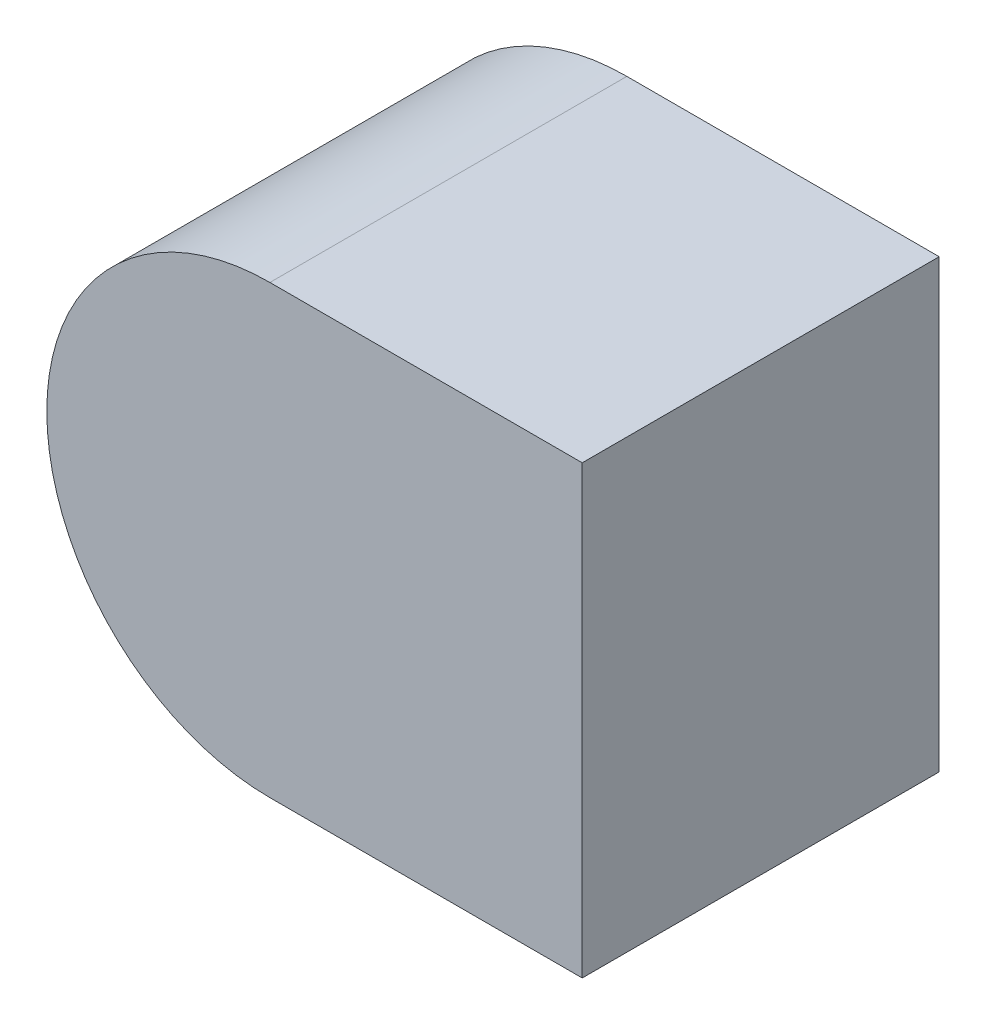
ISO-10303-21;
HEADER;
FILE_DESCRIPTION(('STEP AP214'),'2;1');
FILE_NAME('part.step','',(''),(''),'','','');
FILE_SCHEMA(('AUTOMOTIVE_DESIGN { 1 0 10303 214 1 1 1 1 }'));
ENDSEC;
DATA;
#1=APPLICATION_CONTEXT('core data for automotive mechanical design processes');
#2=APPLICATION_PROTOCOL_DEFINITION('international standard','automotive_design',2000,#1);
#3=PRODUCT_CONTEXT('',#1,'mechanical');
#4=PRODUCT('Part','Part','',(#3));
#5=PRODUCT_RELATED_PRODUCT_CATEGORY('part','',(#4));
#6=PRODUCT_DEFINITION_FORMATION('','',#4);
#7=PRODUCT_DEFINITION_CONTEXT('part definition',#1,'design');
#8=PRODUCT_DEFINITION('design','',#6,#7);
#9=PRODUCT_DEFINITION_SHAPE('','',#8);
#10=(LENGTH_UNIT() NAMED_UNIT(*) SI_UNIT(.MILLI.,.METRE.));
#11=(NAMED_UNIT(*) PLANE_ANGLE_UNIT() SI_UNIT($,.RADIAN.));
#12=(NAMED_UNIT(*) SI_UNIT($,.STERADIAN.) SOLID_ANGLE_UNIT());
#13=UNCERTAINTY_MEASURE_WITH_UNIT(LENGTH_MEASURE(1.E-05),#10,'distance_accuracy_value','');
#14=(GEOMETRIC_REPRESENTATION_CONTEXT(3) GLOBAL_UNCERTAINTY_ASSIGNED_CONTEXT((#13)) GLOBAL_UNIT_ASSIGNED_CONTEXT((#10,
#11,#12)) REPRESENTATION_CONTEXT('',''));
#15=CARTESIAN_POINT('',(0.,0.,0.));
#16=DIRECTION('',(0.,0.,1.));
#17=DIRECTION('',(1.,0.,0.));
#18=AXIS2_PLACEMENT_3D('',#15,#16,#17);
#19=CARTESIAN_POINT('',(0.703,-0.625,0.));
#20=DIRECTION('',(0.,-1.,0.));
#21=DIRECTION('',(1.,0.,0.));
#22=AXIS2_PLACEMENT_3D('',#19,#20,#21);
#23=PLANE('',#22);
#24=DIRECTION('',(0.,0.,1.));
#25=VECTOR('',#24,1.);
#26=CARTESIAN_POINT('',(0.828,-0.625,0.));
#27=LINE('',#26,#25);
#28=CARTESIAN_POINT('',(0.828,-0.625,0.));
#29=VERTEX_POINT('',#28);
#30=CARTESIAN_POINT('',(0.828,-0.625,0.2));
#31=VERTEX_POINT('',#30);
#32=EDGE_CURVE('E11',#29,#31,#27,.T.);
#33=ORIENTED_EDGE('',*,*,#32,.T.);
#34=DIRECTION('',(1.,0.,0.));
#35=VECTOR('',#34,1.);
#36=CARTESIAN_POINT('',(0.703,-0.625,0.2));
#37=LINE('',#36,#35);
#38=CARTESIAN_POINT('',(1.003,-0.625,0.2));
#39=VERTEX_POINT('',#38);
#40=EDGE_CURVE('E24',#31,#39,#37,.T.);
#41=ORIENTED_EDGE('',*,*,#40,.T.);
#42=DIRECTION('',(0.,0.,1.));
#43=VECTOR('',#42,1.);
#44=CARTESIAN_POINT('',(1.003,-0.625,0.));
#45=LINE('',#44,#43);
#46=CARTESIAN_POINT('',(1.003,-0.625,0.));
#47=VERTEX_POINT('',#46);
#48=EDGE_CURVE('E75',#47,#39,#45,.T.);
#49=ORIENTED_EDGE('',*,*,#48,.F.);
#50=DIRECTION('',(1.,0.,0.));
#51=VECTOR('',#50,1.);
#52=CARTESIAN_POINT('',(0.703,-0.625,0.));
#53=LINE('',#52,#51);
#54=EDGE_CURVE('E86',#29,#47,#53,.T.);
#55=ORIENTED_EDGE('',*,*,#54,.F.);
#56=EDGE_LOOP('',(#33,#41,#49,#55));
#57=FACE_BOUND('',#56,.T.);
#58=ADVANCED_FACE('F17',(#57),#23,.F.);
#59=CARTESIAN_POINT('',(0.852999999999999,-0.75,0.));
#60=DIRECTION('',(0.,0.,-1.));
#61=DIRECTION('',(-1.,0.,0.));
#62=AXIS2_PLACEMENT_3D('',#59,#60,#61);
#63=PLANE('',#62);
#64=CARTESIAN_POINT('',(0.828,-0.75,0.));
#65=DIRECTION('',(0.,0.,-1.));
#66=DIRECTION('',(-0.707106781186548,0.707106781186547,0.));
#67=AXIS2_PLACEMENT_3D('',#64,#65,#66);
#68=CIRCLE('',#67,0.125);
#69=CARTESIAN_POINT('',(0.828,-0.875,0.));
#70=VERTEX_POINT('',#69);
#71=EDGE_CURVE('E83',#70,#29,#68,.T.);
#72=ORIENTED_EDGE('',*,*,#71,.T.);
#73=ORIENTED_EDGE('',*,*,#54,.T.);
#74=DIRECTION('',(0.,-1.,0.));
#75=VECTOR('',#74,1.);
#76=CARTESIAN_POINT('',(1.003,-0.625,0.));
#77=LINE('',#76,#75);
#78=CARTESIAN_POINT('',(1.003,-0.875,0.));
#79=VERTEX_POINT('',#78);
#80=EDGE_CURVE('E81',#47,#79,#77,.T.);
#81=ORIENTED_EDGE('',*,*,#80,.T.);
#82=DIRECTION('',(-1.,0.,0.));
#83=VECTOR('',#82,1.);
#84=CARTESIAN_POINT('',(1.003,-0.875,0.));
#85=LINE('',#84,#83);
#86=EDGE_CURVE('E60',#79,#70,#85,.T.);
#87=ORIENTED_EDGE('',*,*,#86,.T.);
#88=EDGE_LOOP('',(#72,#73,#81,#87));
#89=FACE_BOUND('',#88,.T.);
#90=ADVANCED_FACE('F91',(#89),#63,.T.);
#91=CARTESIAN_POINT('',(0.828,-0.75,0.));
#92=DIRECTION('',(0.,0.,-1.));
#93=DIRECTION('',(-0.707106781186547,-0.707106781186548,0.));
#94=AXIS2_PLACEMENT_3D('',#91,#92,#93);
#95=CYLINDRICAL_SURFACE('',#94,0.125);
#96=CARTESIAN_POINT('',(0.828,-0.75,0.2));
#97=DIRECTION('',(0.,0.,1.));
#98=DIRECTION('',(-0.707106781186548,0.707106781186547,0.));
#99=AXIS2_PLACEMENT_3D('',#96,#97,#98);
#100=CIRCLE('',#99,0.125);
#101=CARTESIAN_POINT('',(0.828,-0.875,0.2));
#102=VERTEX_POINT('',#101);
#103=EDGE_CURVE('E70',#31,#102,#100,.T.);
#104=ORIENTED_EDGE('',*,*,#103,.F.);
#105=ORIENTED_EDGE('',*,*,#32,.F.);
#106=ORIENTED_EDGE('',*,*,#71,.F.);
#107=DIRECTION('',(0.,0.,-1.));
#108=VECTOR('',#107,1.);
#109=CARTESIAN_POINT('',(0.828,-0.875,0.));
#110=LINE('',#109,#108);
#111=EDGE_CURVE('E64',#102,#70,#110,.T.);
#112=ORIENTED_EDGE('',*,*,#111,.F.);
#113=EDGE_LOOP('',(#104,#105,#106,#112));
#114=FACE_BOUND('',#113,.T.);
#115=ADVANCED_FACE('F89',(#114),#95,.T.);
#116=CARTESIAN_POINT('',(1.003,-0.875,0.));
#117=DIRECTION('',(0.,1.,0.));
#118=DIRECTION('',(-1.,0.,0.));
#119=AXIS2_PLACEMENT_3D('',#116,#117,#118);
#120=PLANE('',#119);
#121=ORIENTED_EDGE('',*,*,#111,.T.);
#122=ORIENTED_EDGE('',*,*,#86,.F.);
#123=DIRECTION('',(0.,0.,1.));
#124=VECTOR('',#123,1.);
#125=CARTESIAN_POINT('',(1.003,-0.875,0.));
#126=LINE('',#125,#124);
#127=CARTESIAN_POINT('',(1.003,-0.875,0.2));
#128=VERTEX_POINT('',#127);
#129=EDGE_CURVE('E54',#79,#128,#126,.T.);
#130=ORIENTED_EDGE('',*,*,#129,.T.);
#131=DIRECTION('',(-1.,0.,0.));
#132=VECTOR('',#131,1.);
#133=CARTESIAN_POINT('',(1.003,-0.875,0.2));
#134=LINE('',#133,#132);
#135=EDGE_CURVE('E58',#128,#102,#134,.T.);
#136=ORIENTED_EDGE('',*,*,#135,.T.);
#137=EDGE_LOOP('',(#121,#122,#130,#136));
#138=FACE_BOUND('',#137,.T.);
#139=ADVANCED_FACE('F57',(#138),#120,.F.);
#140=CARTESIAN_POINT('',(1.003,-0.625,0.));
#141=DIRECTION('',(-1.,0.,0.));
#142=DIRECTION('',(0.,-1.,0.));
#143=AXIS2_PLACEMENT_3D('',#140,#141,#142);
#144=PLANE('',#143);
#145=ORIENTED_EDGE('',*,*,#80,.F.);
#146=ORIENTED_EDGE('',*,*,#48,.T.);
#147=DIRECTION('',(0.,-1.,0.));
#148=VECTOR('',#147,1.);
#149=CARTESIAN_POINT('',(1.003,-0.625,0.2));
#150=LINE('',#149,#148);
#151=EDGE_CURVE('E69',#39,#128,#150,.T.);
#152=ORIENTED_EDGE('',*,*,#151,.T.);
#153=ORIENTED_EDGE('',*,*,#129,.F.);
#154=EDGE_LOOP('',(#145,#146,#152,#153));
#155=FACE_BOUND('',#154,.T.);
#156=ADVANCED_FACE('F74',(#155),#144,.F.);
#157=CARTESIAN_POINT('',(0.852999999999999,-0.75,0.2));
#158=DIRECTION('',(0.,0.,-1.));
#159=DIRECTION('',(-1.,0.,0.));
#160=AXIS2_PLACEMENT_3D('',#157,#158,#159);
#161=PLANE('',#160);
#162=ORIENTED_EDGE('',*,*,#103,.T.);
#163=ORIENTED_EDGE('',*,*,#135,.F.);
#164=ORIENTED_EDGE('',*,*,#151,.F.);
#165=ORIENTED_EDGE('',*,*,#40,.F.);
#166=EDGE_LOOP('',(#162,#163,#164,#165));
#167=FACE_BOUND('',#166,.T.);
#168=ADVANCED_FACE('F68',(#167),#161,.F.);
#169=CLOSED_SHELL('',(#58,#90,#115,#139,#156,#168));
#170=MANIFOLD_SOLID_BREP('B1',#169);
#171=ADVANCED_BREP_SHAPE_REPRESENTATION('',(#18,#170),#14);
#172=SHAPE_DEFINITION_REPRESENTATION(#9,#171);
ENDSEC;
END-ISO-10303-21;
